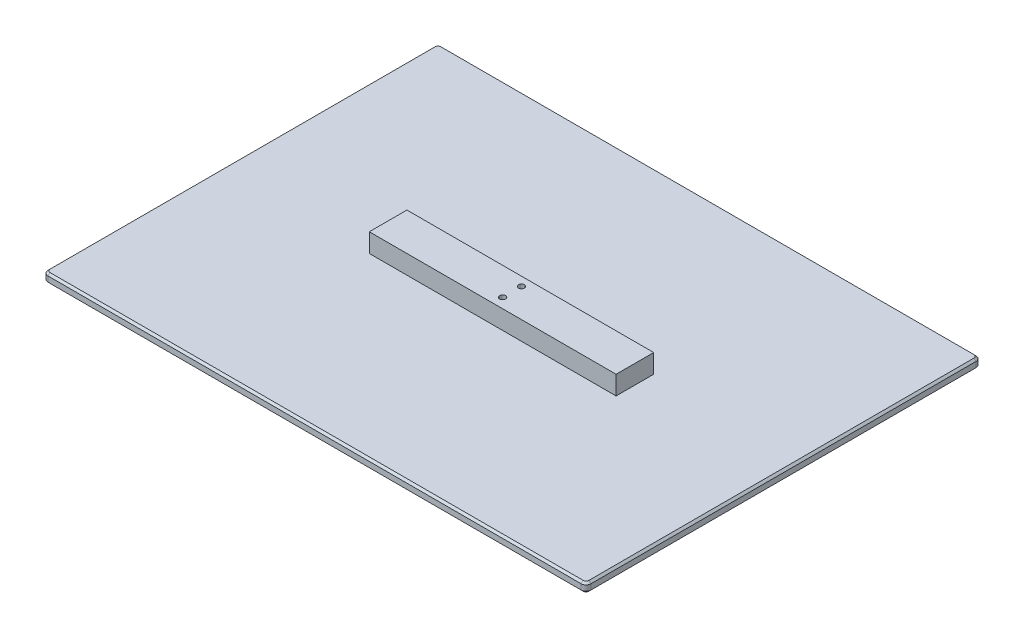
ISO-10303-21;
HEADER;
FILE_DESCRIPTION(('STEP AP214'),'2;1');
FILE_NAME('part.step','',(''),(''),'','','');
FILE_SCHEMA(('AUTOMOTIVE_DESIGN { 1 0 10303 214 1 1 1 1 }'));
ENDSEC;
DATA;
#1=APPLICATION_CONTEXT('core data for automotive mechanical design processes');
#2=APPLICATION_PROTOCOL_DEFINITION('international standard','automotive_design',2000,#1);
#3=PRODUCT_CONTEXT('',#1,'mechanical');
#4=PRODUCT('Part','Part','',(#3));
#5=PRODUCT_RELATED_PRODUCT_CATEGORY('part','',(#4));
#6=PRODUCT_DEFINITION_FORMATION('','',#4);
#7=PRODUCT_DEFINITION_CONTEXT('part definition',#1,'design');
#8=PRODUCT_DEFINITION('design','',#6,#7);
#9=PRODUCT_DEFINITION_SHAPE('','',#8);
#10=(LENGTH_UNIT() NAMED_UNIT(*) SI_UNIT(.MILLI.,.METRE.));
#11=(NAMED_UNIT(*) PLANE_ANGLE_UNIT() SI_UNIT($,.RADIAN.));
#12=(NAMED_UNIT(*) SI_UNIT($,.STERADIAN.) SOLID_ANGLE_UNIT());
#13=UNCERTAINTY_MEASURE_WITH_UNIT(LENGTH_MEASURE(1.E-05),#10,'distance_accuracy_value','');
#14=(GEOMETRIC_REPRESENTATION_CONTEXT(3) GLOBAL_UNCERTAINTY_ASSIGNED_CONTEXT((#13)) GLOBAL_UNIT_ASSIGNED_CONTEXT((#10,
#11,#12)) REPRESENTATION_CONTEXT('',''));
#15=CARTESIAN_POINT('',(0.,0.,0.));
#16=DIRECTION('',(0.,0.,1.));
#17=DIRECTION('',(1.,0.,0.));
#18=AXIS2_PLACEMENT_3D('',#15,#16,#17);
#19=CARTESIAN_POINT('',(0.,9.525,0.));
#20=DIRECTION('',(0.,1.,0.));
#21=DIRECTION('',(0.,0.,1.));
#22=AXIS2_PLACEMENT_3D('',#19,#20,#21);
#23=PLANE('',#22);
#24=CARTESIAN_POINT('',(270.,9.525,-195.));
#25=DIRECTION('',(0.,1.,0.));
#26=DIRECTION('',(0.,0.,1.));
#27=AXIS2_PLACEMENT_3D('',#24,#25,#26);
#28=CIRCLE('',#27,3.);
#29=CARTESIAN_POINT('',(273.,9.525,-195.));
#30=VERTEX_POINT('',#29);
#31=CARTESIAN_POINT('',(270.,9.525,-198.));
#32=VERTEX_POINT('',#31);
#33=EDGE_CURVE('E235',#30,#32,#28,.T.);
#34=ORIENTED_EDGE('',*,*,#33,.T.);
#35=DIRECTION('',(-1.,0.,0.));
#36=VECTOR('',#35,1.);
#37=CARTESIAN_POINT('',(-270.,9.525,-198.));
#38=LINE('',#37,#36);
#39=CARTESIAN_POINT('',(-270.,9.525,-198.));
#40=VERTEX_POINT('',#39);
#41=EDGE_CURVE('E239',#32,#40,#38,.T.);
#42=ORIENTED_EDGE('',*,*,#41,.T.);
#43=CARTESIAN_POINT('',(-270.,9.525,-195.));
#44=DIRECTION('',(0.,1.,0.));
#45=DIRECTION('',(0.,0.,1.));
#46=AXIS2_PLACEMENT_3D('',#43,#44,#45);
#47=CIRCLE('',#46,3.);
#48=CARTESIAN_POINT('',(-273.,9.525,-195.));
#49=VERTEX_POINT('',#48);
#50=EDGE_CURVE('E237',#40,#49,#47,.T.);
#51=ORIENTED_EDGE('',*,*,#50,.T.);
#52=DIRECTION('',(0.,0.,1.));
#53=VECTOR('',#52,1.);
#54=CARTESIAN_POINT('',(-273.,9.525,195.));
#55=LINE('',#54,#53);
#56=CARTESIAN_POINT('',(-273.,9.525,195.));
#57=VERTEX_POINT('',#56);
#58=EDGE_CURVE('E233',#49,#57,#55,.T.);
#59=ORIENTED_EDGE('',*,*,#58,.T.);
#60=CARTESIAN_POINT('',(-270.,9.525,195.));
#61=DIRECTION('',(0.,1.,0.));
#62=DIRECTION('',(0.,0.,1.));
#63=AXIS2_PLACEMENT_3D('',#60,#61,#62);
#64=CIRCLE('',#63,3.);
#65=CARTESIAN_POINT('',(-270.,9.525,198.));
#66=VERTEX_POINT('',#65);
#67=EDGE_CURVE('E229',#57,#66,#64,.T.);
#68=ORIENTED_EDGE('',*,*,#67,.T.);
#69=DIRECTION('',(1.,0.,0.));
#70=VECTOR('',#69,1.);
#71=CARTESIAN_POINT('',(270.,9.525,198.));
#72=LINE('',#71,#70);
#73=CARTESIAN_POINT('',(270.,9.525,198.));
#74=VERTEX_POINT('',#73);
#75=EDGE_CURVE('E225',#66,#74,#72,.T.);
#76=ORIENTED_EDGE('',*,*,#75,.T.);
#77=CARTESIAN_POINT('',(270.,9.525,195.));
#78=DIRECTION('',(0.,1.,0.));
#79=DIRECTION('',(0.,0.,1.));
#80=AXIS2_PLACEMENT_3D('',#77,#78,#79);
#81=CIRCLE('',#80,3.);
#82=CARTESIAN_POINT('',(273.,9.525,195.));
#83=VERTEX_POINT('',#82);
#84=EDGE_CURVE('E227',#74,#83,#81,.T.);
#85=ORIENTED_EDGE('',*,*,#84,.T.);
#86=DIRECTION('',(0.,0.,-1.));
#87=VECTOR('',#86,1.);
#88=CARTESIAN_POINT('',(273.,9.525,-195.));
#89=LINE('',#88,#87);
#90=EDGE_CURVE('E231',#83,#30,#89,.T.);
#91=ORIENTED_EDGE('',*,*,#90,.T.);
#92=EDGE_LOOP('',(#34,#42,#51,#59,#68,#76,#85,#91));
#93=FACE_BOUND('',#92,.T.);
#94=DIRECTION('',(-1.,0.,0.));
#95=VECTOR('',#94,1.);
#96=CARTESIAN_POINT('',(-125.,9.525,-18.55));
#97=LINE('',#96,#95);
#98=CARTESIAN_POINT('',(125.,9.525,-18.55));
#99=VERTEX_POINT('',#98);
#100=CARTESIAN_POINT('',(-125.,9.525,-18.55));
#101=VERTEX_POINT('',#100);
#102=EDGE_CURVE('E743',#99,#101,#97,.T.);
#103=ORIENTED_EDGE('',*,*,#102,.F.);
#104=DIRECTION('',(0.,0.,-1.));
#105=VECTOR('',#104,1.);
#106=CARTESIAN_POINT('',(125.,9.525,-18.55));
#107=LINE('',#106,#105);
#108=CARTESIAN_POINT('',(125.,9.525,19.55));
#109=VERTEX_POINT('',#108);
#110=EDGE_CURVE('E196',#109,#99,#107,.T.);
#111=ORIENTED_EDGE('',*,*,#110,.F.);
#112=DIRECTION('',(1.,0.,0.));
#113=VECTOR('',#112,1.);
#114=CARTESIAN_POINT('',(-125.,9.525,19.55));
#115=LINE('',#114,#113);
#116=CARTESIAN_POINT('',(-125.,9.525,19.55));
#117=VERTEX_POINT('',#116);
#118=EDGE_CURVE('E192',#117,#109,#115,.T.);
#119=ORIENTED_EDGE('',*,*,#118,.F.);
#120=DIRECTION('',(0.,0.,1.));
#121=VECTOR('',#120,1.);
#122=CARTESIAN_POINT('',(-125.,9.525,-18.55));
#123=LINE('',#122,#121);
#124=EDGE_CURVE('E745',#101,#117,#123,.T.);
#125=ORIENTED_EDGE('',*,*,#124,.F.);
#126=EDGE_LOOP('',(#103,#111,#119,#125));
#127=FACE_BOUND('',#126,.T.);
#128=ADVANCED_FACE('F35',(#93,#127),#23,.T.);
#129=CARTESIAN_POINT('',(275.,9.525,-200.));
#130=DIRECTION('',(-1.,0.,0.));
#131=DIRECTION('',(0.,0.,1.));
#132=AXIS2_PLACEMENT_3D('',#129,#130,#131);
#133=PLANE('',#132);
#134=DIRECTION('',(0.,-1.,0.));
#135=VECTOR('',#134,1.);
#136=CARTESIAN_POINT('',(275.,9.525,195.));
#137=LINE('',#136,#135);
#138=CARTESIAN_POINT('',(275.,7.52500000000005,195.));
#139=VERTEX_POINT('',#138);
#140=CARTESIAN_POINT('',(275.,1.99999999999995,195.));
#141=VERTEX_POINT('',#140);
#142=EDGE_CURVE('E216',#139,#141,#137,.T.);
#143=ORIENTED_EDGE('',*,*,#142,.T.);
#144=DIRECTION('',(0.,0.,-1.));
#145=VECTOR('',#144,1.);
#146=CARTESIAN_POINT('',(275.,1.99999999999995,-200.));
#147=LINE('',#146,#145);
#148=CARTESIAN_POINT('',(275.,1.99999999999995,-195.));
#149=VERTEX_POINT('',#148);
#150=EDGE_CURVE('E310',#141,#149,#147,.T.);
#151=ORIENTED_EDGE('',*,*,#150,.T.);
#152=DIRECTION('',(0.,-1.,0.));
#153=VECTOR('',#152,1.);
#154=CARTESIAN_POINT('',(275.,9.525,-195.));
#155=LINE('',#154,#153);
#156=CARTESIAN_POINT('',(275.,7.52500000000005,-195.));
#157=VERTEX_POINT('',#156);
#158=EDGE_CURVE('E219',#149,#157,#155,.F.);
#159=ORIENTED_EDGE('',*,*,#158,.T.);
#160=DIRECTION('',(0.,0.,1.));
#161=VECTOR('',#160,1.);
#162=CARTESIAN_POINT('',(275.,7.52500000000005,195.));
#163=LINE('',#162,#161);
#164=EDGE_CURVE('E253',#157,#139,#163,.T.);
#165=ORIENTED_EDGE('',*,*,#164,.T.);
#166=EDGE_LOOP('',(#143,#151,#159,#165));
#167=FACE_BOUND('',#166,.T.);
#168=ADVANCED_FACE('F389',(#167),#133,.F.);
#169=CARTESIAN_POINT('',(-275.,9.525,-200.));
#170=DIRECTION('',(0.,0.,1.));
#171=DIRECTION('',(1.,0.,0.));
#172=AXIS2_PLACEMENT_3D('',#169,#170,#171);
#173=PLANE('',#172);
#174=DIRECTION('',(0.,-1.,0.));
#175=VECTOR('',#174,1.);
#176=CARTESIAN_POINT('',(270.,9.525,-200.));
#177=LINE('',#176,#175);
#178=CARTESIAN_POINT('',(270.,7.52500000000005,-200.));
#179=VERTEX_POINT('',#178);
#180=CARTESIAN_POINT('',(270.,1.99999999999995,-200.));
#181=VERTEX_POINT('',#180);
#182=EDGE_CURVE('E211',#179,#181,#177,.T.);
#183=ORIENTED_EDGE('',*,*,#182,.T.);
#184=DIRECTION('',(-1.,0.,0.));
#185=VECTOR('',#184,1.);
#186=CARTESIAN_POINT('',(-275.,1.99999999999995,-200.));
#187=LINE('',#186,#185);
#188=CARTESIAN_POINT('',(-270.,1.99999999999995,-200.));
#189=VERTEX_POINT('',#188);
#190=EDGE_CURVE('E263',#181,#189,#187,.T.);
#191=ORIENTED_EDGE('',*,*,#190,.T.);
#192=DIRECTION('',(0.,-1.,0.));
#193=VECTOR('',#192,1.);
#194=CARTESIAN_POINT('',(-270.,9.525,-200.));
#195=LINE('',#194,#193);
#196=CARTESIAN_POINT('',(-270.,7.52500000000005,-200.));
#197=VERTEX_POINT('',#196);
#198=EDGE_CURVE('E214',#189,#197,#195,.F.);
#199=ORIENTED_EDGE('',*,*,#198,.T.);
#200=DIRECTION('',(1.,0.,0.));
#201=VECTOR('',#200,1.);
#202=CARTESIAN_POINT('',(270.,7.52500000000005,-200.));
#203=LINE('',#202,#201);
#204=EDGE_CURVE('E242',#197,#179,#203,.T.);
#205=ORIENTED_EDGE('',*,*,#204,.T.);
#206=EDGE_LOOP('',(#183,#191,#199,#205));
#207=FACE_BOUND('',#206,.T.);
#208=ADVANCED_FACE('F361',(#207),#173,.F.);
#209=CARTESIAN_POINT('',(-275.,9.525,-200.));
#210=DIRECTION('',(1.,0.,0.));
#211=DIRECTION('',(0.,0.,-1.));
#212=AXIS2_PLACEMENT_3D('',#209,#210,#211);
#213=PLANE('',#212);
#214=DIRECTION('',(0.,-1.,0.));
#215=VECTOR('',#214,1.);
#216=CARTESIAN_POINT('',(-275.,9.525,-195.));
#217=LINE('',#216,#215);
#218=CARTESIAN_POINT('',(-275.,7.52500000000005,-195.));
#219=VERTEX_POINT('',#218);
#220=CARTESIAN_POINT('',(-275.,1.99999999999995,-195.));
#221=VERTEX_POINT('',#220);
#222=EDGE_CURVE('E207',#219,#221,#217,.T.);
#223=ORIENTED_EDGE('',*,*,#222,.T.);
#224=DIRECTION('',(0.,0.,1.));
#225=VECTOR('',#224,1.);
#226=CARTESIAN_POINT('',(-275.,1.99999999999995,-200.));
#227=LINE('',#226,#225);
#228=CARTESIAN_POINT('',(-275.,1.99999999999995,195.));
#229=VERTEX_POINT('',#228);
#230=EDGE_CURVE('E308',#221,#229,#227,.T.);
#231=ORIENTED_EDGE('',*,*,#230,.T.);
#232=DIRECTION('',(0.,-1.,0.));
#233=VECTOR('',#232,1.);
#234=CARTESIAN_POINT('',(-275.,9.525,195.));
#235=LINE('',#234,#233);
#236=CARTESIAN_POINT('',(-275.,7.52500000000005,195.));
#237=VERTEX_POINT('',#236);
#238=EDGE_CURVE('E205',#229,#237,#235,.F.);
#239=ORIENTED_EDGE('',*,*,#238,.T.);
#240=DIRECTION('',(0.,0.,-1.));
#241=VECTOR('',#240,1.);
#242=CARTESIAN_POINT('',(-275.,7.52500000000005,-195.));
#243=LINE('',#242,#241);
#244=EDGE_CURVE('E251',#237,#219,#243,.T.);
#245=ORIENTED_EDGE('',*,*,#244,.T.);
#246=EDGE_LOOP('',(#223,#231,#239,#245));
#247=FACE_BOUND('',#246,.T.);
#248=ADVANCED_FACE('F427',(#247),#213,.F.);
#249=CARTESIAN_POINT('',(-275.,9.525,200.));
#250=DIRECTION('',(0.,0.,-1.));
#251=DIRECTION('',(-1.,0.,0.));
#252=AXIS2_PLACEMENT_3D('',#249,#250,#251);
#253=PLANE('',#252);
#254=DIRECTION('',(0.,-1.,0.));
#255=VECTOR('',#254,1.);
#256=CARTESIAN_POINT('',(-270.,9.525,200.));
#257=LINE('',#256,#255);
#258=CARTESIAN_POINT('',(-270.,7.52500000000005,200.));
#259=VERTEX_POINT('',#258);
#260=CARTESIAN_POINT('',(-270.,1.99999999999995,200.));
#261=VERTEX_POINT('',#260);
#262=EDGE_CURVE('E221',#259,#261,#257,.T.);
#263=ORIENTED_EDGE('',*,*,#262,.T.);
#264=DIRECTION('',(1.,0.,0.));
#265=VECTOR('',#264,1.);
#266=CARTESIAN_POINT('',(-275.,1.99999999999995,200.));
#267=LINE('',#266,#265);
#268=CARTESIAN_POINT('',(270.,1.99999999999995,200.));
#269=VERTEX_POINT('',#268);
#270=EDGE_CURVE('E11',#261,#269,#267,.T.);
#271=ORIENTED_EDGE('',*,*,#270,.T.);
#272=DIRECTION('',(0.,-1.,0.));
#273=VECTOR('',#272,1.);
#274=CARTESIAN_POINT('',(270.,9.525,200.));
#275=LINE('',#274,#273);
#276=CARTESIAN_POINT('',(270.,7.52500000000005,200.));
#277=VERTEX_POINT('',#276);
#278=EDGE_CURVE('E223',#269,#277,#275,.F.);
#279=ORIENTED_EDGE('',*,*,#278,.T.);
#280=DIRECTION('',(-1.,0.,0.));
#281=VECTOR('',#280,1.);
#282=CARTESIAN_POINT('',(-270.,7.52500000000005,200.));
#283=LINE('',#282,#281);
#284=EDGE_CURVE('E261',#277,#259,#283,.T.);
#285=ORIENTED_EDGE('',*,*,#284,.T.);
#286=EDGE_LOOP('',(#263,#271,#279,#285));
#287=FACE_BOUND('',#286,.T.);
#288=ADVANCED_FACE('F404',(#287),#253,.F.);
#289=CARTESIAN_POINT('',(0.,0.,0.));
#290=DIRECTION('',(0.,1.,0.));
#291=DIRECTION('',(0.,0.,1.));
#292=AXIS2_PLACEMENT_3D('',#289,#290,#291);
#293=PLANE('',#292);
#294=CARTESIAN_POINT('',(-270.,0.,-195.));
#295=DIRECTION('',(0.,1.,0.));
#296=DIRECTION('',(0.,0.,1.));
#297=AXIS2_PLACEMENT_3D('',#294,#295,#296);
#298=CIRCLE('',#297,3.);
#299=CARTESIAN_POINT('',(-273.,0.,-195.));
#300=VERTEX_POINT('',#299);
#301=CARTESIAN_POINT('',(-270.,0.,-198.));
#302=VERTEX_POINT('',#301);
#303=EDGE_CURVE('E299',#300,#302,#298,.F.);
#304=ORIENTED_EDGE('',*,*,#303,.T.);
#305=DIRECTION('',(1.,0.,0.));
#306=VECTOR('',#305,1.);
#307=CARTESIAN_POINT('',(0.,0.,-198.));
#308=LINE('',#307,#306);
#309=CARTESIAN_POINT('',(270.,0.,-198.));
#310=VERTEX_POINT('',#309);
#311=EDGE_CURVE('E301',#302,#310,#308,.T.);
#312=ORIENTED_EDGE('',*,*,#311,.T.);
#313=CARTESIAN_POINT('',(270.,0.,-195.));
#314=DIRECTION('',(0.,1.,0.));
#315=DIRECTION('',(0.,0.,1.));
#316=AXIS2_PLACEMENT_3D('',#313,#314,#315);
#317=CIRCLE('',#316,3.);
#318=CARTESIAN_POINT('',(273.,0.,-195.));
#319=VERTEX_POINT('',#318);
#320=EDGE_CURVE('E297',#310,#319,#317,.F.);
#321=ORIENTED_EDGE('',*,*,#320,.T.);
#322=DIRECTION('',(0.,0.,1.));
#323=VECTOR('',#322,1.);
#324=CARTESIAN_POINT('',(273.,0.,0.));
#325=LINE('',#324,#323);
#326=CARTESIAN_POINT('',(273.,0.,195.));
#327=VERTEX_POINT('',#326);
#328=EDGE_CURVE('E293',#319,#327,#325,.T.);
#329=ORIENTED_EDGE('',*,*,#328,.T.);
#330=CARTESIAN_POINT('',(270.,0.,195.));
#331=DIRECTION('',(0.,1.,0.));
#332=DIRECTION('',(0.,0.,1.));
#333=AXIS2_PLACEMENT_3D('',#330,#331,#332);
#334=CIRCLE('',#333,3.);
#335=CARTESIAN_POINT('',(270.,0.,198.));
#336=VERTEX_POINT('',#335);
#337=EDGE_CURVE('E289',#327,#336,#334,.F.);
#338=ORIENTED_EDGE('',*,*,#337,.T.);
#339=DIRECTION('',(-1.,0.,0.));
#340=VECTOR('',#339,1.);
#341=CARTESIAN_POINT('',(0.,0.,198.));
#342=LINE('',#341,#340);
#343=CARTESIAN_POINT('',(-270.,0.,198.));
#344=VERTEX_POINT('',#343);
#345=EDGE_CURVE('E287',#336,#344,#342,.T.);
#346=ORIENTED_EDGE('',*,*,#345,.T.);
#347=CARTESIAN_POINT('',(-270.,0.,195.));
#348=DIRECTION('',(0.,1.,0.));
#349=DIRECTION('',(0.,0.,1.));
#350=AXIS2_PLACEMENT_3D('',#347,#348,#349);
#351=CIRCLE('',#350,3.);
#352=CARTESIAN_POINT('',(-273.,0.,195.));
#353=VERTEX_POINT('',#352);
#354=EDGE_CURVE('E291',#344,#353,#351,.F.);
#355=ORIENTED_EDGE('',*,*,#354,.T.);
#356=DIRECTION('',(0.,0.,-1.));
#357=VECTOR('',#356,1.);
#358=CARTESIAN_POINT('',(-273.,0.,0.));
#359=LINE('',#358,#357);
#360=EDGE_CURVE('E295',#353,#300,#359,.T.);
#361=ORIENTED_EDGE('',*,*,#360,.T.);
#362=EDGE_LOOP('',(#304,#312,#321,#329,#338,#346,#355,#361));
#363=FACE_BOUND('',#362,.T.);
#364=ADVANCED_FACE('F343',(#363),#293,.F.);
#365=CARTESIAN_POINT('',(-270.,9.525,-195.));
#366=DIRECTION('',(0.,-1.,0.));
#367=DIRECTION('',(0.,0.,-1.));
#368=AXIS2_PLACEMENT_3D('',#365,#366,#367);
#369=CYLINDRICAL_SURFACE('',#368,5.);
#370=ORIENTED_EDGE('',*,*,#198,.F.);
#371=CARTESIAN_POINT('',(-270.,1.99999999999995,-195.));
#372=DIRECTION('',(0.,1.,0.));
#373=DIRECTION('',(0.,0.,1.));
#374=AXIS2_PLACEMENT_3D('',#371,#372,#373);
#375=CIRCLE('',#374,5.);
#376=EDGE_CURVE('E304',#189,#221,#375,.T.);
#377=ORIENTED_EDGE('',*,*,#376,.T.);
#378=ORIENTED_EDGE('',*,*,#222,.F.);
#379=CARTESIAN_POINT('',(-270.,7.52500000000005,-195.));
#380=DIRECTION('',(0.,1.,0.));
#381=DIRECTION('',(0.,0.,1.));
#382=AXIS2_PLACEMENT_3D('',#379,#380,#381);
#383=CIRCLE('',#382,5.);
#384=EDGE_CURVE('E245',#219,#197,#383,.F.);
#385=ORIENTED_EDGE('',*,*,#384,.T.);
#386=EDGE_LOOP('',(#370,#377,#378,#385));
#387=FACE_BOUND('',#386,.T.);
#388=ADVANCED_FACE('F425',(#387),#369,.T.);
#389=CARTESIAN_POINT('',(270.,9.525,-195.));
#390=DIRECTION('',(0.,-1.,0.));
#391=DIRECTION('',(0.,0.,-1.));
#392=AXIS2_PLACEMENT_3D('',#389,#390,#391);
#393=CYLINDRICAL_SURFACE('',#392,5.);
#394=ORIENTED_EDGE('',*,*,#158,.F.);
#395=CARTESIAN_POINT('',(270.,1.99999999999995,-195.));
#396=DIRECTION('',(0.,1.,0.));
#397=DIRECTION('',(0.,0.,1.));
#398=AXIS2_PLACEMENT_3D('',#395,#396,#397);
#399=CIRCLE('',#398,5.);
#400=EDGE_CURVE('E306',#149,#181,#399,.T.);
#401=ORIENTED_EDGE('',*,*,#400,.T.);
#402=ORIENTED_EDGE('',*,*,#182,.F.);
#403=CARTESIAN_POINT('',(270.,7.52500000000005,-195.));
#404=DIRECTION('',(0.,1.,0.));
#405=DIRECTION('',(0.,0.,1.));
#406=AXIS2_PLACEMENT_3D('',#403,#404,#405);
#407=CIRCLE('',#406,5.);
#408=EDGE_CURVE('E248',#179,#157,#407,.F.);
#409=ORIENTED_EDGE('',*,*,#408,.T.);
#410=EDGE_LOOP('',(#394,#401,#402,#409));
#411=FACE_BOUND('',#410,.T.);
#412=ADVANCED_FACE('F359',(#411),#393,.T.);
#413=CARTESIAN_POINT('',(270.,9.525,195.));
#414=DIRECTION('',(0.,-1.,0.));
#415=DIRECTION('',(0.,0.,-1.));
#416=AXIS2_PLACEMENT_3D('',#413,#414,#415);
#417=CYLINDRICAL_SURFACE('',#416,5.);
#418=ORIENTED_EDGE('',*,*,#278,.F.);
#419=CARTESIAN_POINT('',(270.,1.99999999999995,195.));
#420=DIRECTION('',(0.,1.,0.));
#421=DIRECTION('',(0.,0.,1.));
#422=AXIS2_PLACEMENT_3D('',#419,#420,#421);
#423=CIRCLE('',#422,5.);
#424=EDGE_CURVE('E44',#269,#141,#423,.T.);
#425=ORIENTED_EDGE('',*,*,#424,.T.);
#426=ORIENTED_EDGE('',*,*,#142,.F.);
#427=CARTESIAN_POINT('',(270.,7.52500000000005,195.));
#428=DIRECTION('',(0.,1.,0.));
#429=DIRECTION('',(0.,0.,1.));
#430=AXIS2_PLACEMENT_3D('',#427,#428,#429);
#431=CIRCLE('',#430,5.);
#432=EDGE_CURVE('E258',#139,#277,#431,.F.);
#433=ORIENTED_EDGE('',*,*,#432,.T.);
#434=EDGE_LOOP('',(#418,#425,#426,#433));
#435=FACE_BOUND('',#434,.T.);
#436=ADVANCED_FACE('F392',(#435),#417,.T.);
#437=CARTESIAN_POINT('',(-270.,9.525,195.));
#438=DIRECTION('',(0.,-1.,0.));
#439=DIRECTION('',(0.,0.,-1.));
#440=AXIS2_PLACEMENT_3D('',#437,#438,#439);
#441=CYLINDRICAL_SURFACE('',#440,5.);
#442=ORIENTED_EDGE('',*,*,#238,.F.);
#443=CARTESIAN_POINT('',(-270.,1.99999999999995,195.));
#444=DIRECTION('',(0.,1.,0.));
#445=DIRECTION('',(0.,0.,1.));
#446=AXIS2_PLACEMENT_3D('',#443,#444,#445);
#447=CIRCLE('',#446,5.);
#448=EDGE_CURVE('E312',#229,#261,#447,.T.);
#449=ORIENTED_EDGE('',*,*,#448,.T.);
#450=ORIENTED_EDGE('',*,*,#262,.F.);
#451=CARTESIAN_POINT('',(-270.,7.52500000000005,195.));
#452=DIRECTION('',(0.,1.,0.));
#453=DIRECTION('',(0.,0.,1.));
#454=AXIS2_PLACEMENT_3D('',#451,#452,#453);
#455=CIRCLE('',#454,5.);
#456=EDGE_CURVE('E255',#259,#237,#455,.F.);
#457=ORIENTED_EDGE('',*,*,#456,.T.);
#458=EDGE_LOOP('',(#442,#449,#450,#457));
#459=FACE_BOUND('',#458,.T.);
#460=ADVANCED_FACE('F407',(#459),#441,.T.);
#461=CARTESIAN_POINT('',(0.,9.525,198.));
#462=DIRECTION('',(0.,0.707106781186557,0.707106781186538));
#463=DIRECTION('',(-1.,0.,0.));
#464=AXIS2_PLACEMENT_3D('',#461,#462,#463);
#465=PLANE('',#464);
#466=DIRECTION('',(0.,0.707106781186538,-0.707106781186557));
#467=VECTOR('',#466,1.);
#468=CARTESIAN_POINT('',(-270.,7.52500000000005,200.));
#469=LINE('',#468,#467);
#470=EDGE_CURVE('E280',#259,#66,#469,.T.);
#471=ORIENTED_EDGE('',*,*,#470,.F.);
#472=ORIENTED_EDGE('',*,*,#284,.F.);
#473=DIRECTION('',(0.,-0.707106781186538,0.707106781186557));
#474=VECTOR('',#473,1.);
#475=CARTESIAN_POINT('',(270.,9.525,198.));
#476=LINE('',#475,#474);
#477=EDGE_CURVE('E208',#74,#277,#476,.T.);
#478=ORIENTED_EDGE('',*,*,#477,.F.);
#479=ORIENTED_EDGE('',*,*,#75,.F.);
#480=EDGE_LOOP('',(#471,#472,#478,#479));
#481=FACE_BOUND('',#480,.T.);
#482=ADVANCED_FACE('F401',(#481),#465,.T.);
#483=CARTESIAN_POINT('',(270.,9.525,195.));
#484=DIRECTION('',(0.,-1.,0.));
#485=DIRECTION('',(0.,0.,-1.));
#486=AXIS2_PLACEMENT_3D('',#483,#484,#485);
#487=CONICAL_SURFACE('',#486,3.,0.785398163397461);
#488=ORIENTED_EDGE('',*,*,#477,.T.);
#489=ORIENTED_EDGE('',*,*,#432,.F.);
#490=DIRECTION('',(0.707106781186557,-0.707106781186538,0.));
#491=VECTOR('',#490,1.);
#492=CARTESIAN_POINT('',(273.,9.525,195.));
#493=LINE('',#492,#491);
#494=EDGE_CURVE('E277',#83,#139,#493,.T.);
#495=ORIENTED_EDGE('',*,*,#494,.F.);
#496=ORIENTED_EDGE('',*,*,#84,.F.);
#497=EDGE_LOOP('',(#488,#489,#495,#496));
#498=FACE_BOUND('',#497,.T.);
#499=ADVANCED_FACE('F395',(#498),#487,.T.);
#500=CARTESIAN_POINT('',(-270.,9.525,195.));
#501=DIRECTION('',(0.,-1.,0.));
#502=DIRECTION('',(0.,0.,-1.));
#503=AXIS2_PLACEMENT_3D('',#500,#501,#502);
#504=CONICAL_SURFACE('',#503,3.,0.785398163397461);
#505=ORIENTED_EDGE('',*,*,#470,.T.);
#506=ORIENTED_EDGE('',*,*,#67,.F.);
#507=DIRECTION('',(0.707106781186557,0.707106781186538,0.));
#508=VECTOR('',#507,1.);
#509=CARTESIAN_POINT('',(-275.,7.52500000000005,195.));
#510=LINE('',#509,#508);
#511=EDGE_CURVE('E274',#237,#57,#510,.T.);
#512=ORIENTED_EDGE('',*,*,#511,.F.);
#513=ORIENTED_EDGE('',*,*,#456,.F.);
#514=EDGE_LOOP('',(#505,#506,#512,#513));
#515=FACE_BOUND('',#514,.T.);
#516=ADVANCED_FACE('F433',(#515),#504,.T.);
#517=CARTESIAN_POINT('',(273.,9.525,0.));
#518=DIRECTION('',(0.707106781186538,0.707106781186557,0.));
#519=DIRECTION('',(0.,0.,1.));
#520=AXIS2_PLACEMENT_3D('',#517,#518,#519);
#521=PLANE('',#520);
#522=ORIENTED_EDGE('',*,*,#494,.T.);
#523=ORIENTED_EDGE('',*,*,#164,.F.);
#524=DIRECTION('',(0.707106781186557,-0.707106781186538,0.));
#525=VECTOR('',#524,1.);
#526=CARTESIAN_POINT('',(273.,9.525,-195.));
#527=LINE('',#526,#525);
#528=EDGE_CURVE('E271',#30,#157,#527,.T.);
#529=ORIENTED_EDGE('',*,*,#528,.F.);
#530=ORIENTED_EDGE('',*,*,#90,.F.);
#531=EDGE_LOOP('',(#522,#523,#529,#530));
#532=FACE_BOUND('',#531,.T.);
#533=ADVANCED_FACE('F385',(#532),#521,.T.);
#534=CARTESIAN_POINT('',(-273.,9.525,0.));
#535=DIRECTION('',(-0.707106781186538,0.707106781186557,0.));
#536=DIRECTION('',(0.,0.,-1.));
#537=AXIS2_PLACEMENT_3D('',#534,#535,#536);
#538=PLANE('',#537);
#539=ORIENTED_EDGE('',*,*,#511,.T.);
#540=ORIENTED_EDGE('',*,*,#58,.F.);
#541=DIRECTION('',(0.707106781186557,0.707106781186538,0.));
#542=VECTOR('',#541,1.);
#543=CARTESIAN_POINT('',(-275.,7.52500000000005,-195.));
#544=LINE('',#543,#542);
#545=EDGE_CURVE('E268',#219,#49,#544,.T.);
#546=ORIENTED_EDGE('',*,*,#545,.F.);
#547=ORIENTED_EDGE('',*,*,#244,.F.);
#548=EDGE_LOOP('',(#539,#540,#546,#547));
#549=FACE_BOUND('',#548,.T.);
#550=ADVANCED_FACE('F430',(#549),#538,.T.);
#551=CARTESIAN_POINT('',(270.,9.525,-195.));
#552=DIRECTION('',(0.,-1.,0.));
#553=DIRECTION('',(0.,0.,-1.));
#554=AXIS2_PLACEMENT_3D('',#551,#552,#553);
#555=CONICAL_SURFACE('',#554,3.,0.785398163397461);
#556=ORIENTED_EDGE('',*,*,#528,.T.);
#557=ORIENTED_EDGE('',*,*,#408,.F.);
#558=DIRECTION('',(0.,-0.707106781186538,-0.707106781186557));
#559=VECTOR('',#558,1.);
#560=CARTESIAN_POINT('',(270.,9.525,-198.));
#561=LINE('',#560,#559);
#562=EDGE_CURVE('E266',#32,#179,#561,.T.);
#563=ORIENTED_EDGE('',*,*,#562,.F.);
#564=ORIENTED_EDGE('',*,*,#33,.F.);
#565=EDGE_LOOP('',(#556,#557,#563,#564));
#566=FACE_BOUND('',#565,.T.);
#567=ADVANCED_FACE('F382',(#566),#555,.T.);
#568=CARTESIAN_POINT('',(-270.,9.525,-195.));
#569=DIRECTION('',(0.,-1.,0.));
#570=DIRECTION('',(0.,0.,-1.));
#571=AXIS2_PLACEMENT_3D('',#568,#569,#570);
#572=CONICAL_SURFACE('',#571,3.,0.785398163397461);
#573=ORIENTED_EDGE('',*,*,#545,.T.);
#574=ORIENTED_EDGE('',*,*,#50,.F.);
#575=DIRECTION('',(0.,0.707106781186538,0.707106781186557));
#576=VECTOR('',#575,1.);
#577=CARTESIAN_POINT('',(-270.,7.52500000000005,-200.));
#578=LINE('',#577,#576);
#579=EDGE_CURVE('E264',#197,#40,#578,.T.);
#580=ORIENTED_EDGE('',*,*,#579,.F.);
#581=ORIENTED_EDGE('',*,*,#384,.F.);
#582=EDGE_LOOP('',(#573,#574,#580,#581));
#583=FACE_BOUND('',#582,.T.);
#584=ADVANCED_FACE('F373',(#583),#572,.T.);
#585=CARTESIAN_POINT('',(0.,9.525,-198.));
#586=DIRECTION('',(0.,0.707106781186557,-0.707106781186538));
#587=DIRECTION('',(1.,0.,0.));
#588=AXIS2_PLACEMENT_3D('',#585,#586,#587);
#589=PLANE('',#588);
#590=ORIENTED_EDGE('',*,*,#562,.T.);
#591=ORIENTED_EDGE('',*,*,#204,.F.);
#592=ORIENTED_EDGE('',*,*,#579,.T.);
#593=ORIENTED_EDGE('',*,*,#41,.F.);
#594=EDGE_LOOP('',(#590,#591,#592,#593));
#595=FACE_BOUND('',#594,.T.);
#596=ADVANCED_FACE('F366',(#595),#589,.T.);
#597=CARTESIAN_POINT('',(-275.,1.99999999999995,200.));
#598=DIRECTION('',(0.,0.707106781186557,-0.707106781186538));
#599=DIRECTION('',(1.,0.,0.));
#600=AXIS2_PLACEMENT_3D('',#597,#598,#599);
#601=PLANE('',#600);
#602=DIRECTION('',(0.,0.707106781186538,0.707106781186557));
#603=VECTOR('',#602,1.);
#604=CARTESIAN_POINT('',(-270.,0.,198.));
#605=LINE('',#604,#603);
#606=EDGE_CURVE('E327',#344,#261,#605,.T.);
#607=ORIENTED_EDGE('',*,*,#606,.F.);
#608=ORIENTED_EDGE('',*,*,#345,.F.);
#609=DIRECTION('',(0.,-0.707106781186538,-0.707106781186557));
#610=VECTOR('',#609,1.);
#611=CARTESIAN_POINT('',(270.,1.99999999999995,200.));
#612=LINE('',#611,#610);
#613=EDGE_CURVE('E39',#269,#336,#612,.T.);
#614=ORIENTED_EDGE('',*,*,#613,.F.);
#615=ORIENTED_EDGE('',*,*,#270,.F.);
#616=EDGE_LOOP('',(#607,#608,#614,#615));
#617=FACE_BOUND('',#616,.T.);
#618=ADVANCED_FACE('F37',(#617),#601,.F.);
#619=CARTESIAN_POINT('',(270.,0.,195.));
#620=DIRECTION('',(0.,1.,0.));
#621=DIRECTION('',(0.,0.,1.));
#622=AXIS2_PLACEMENT_3D('',#619,#620,#621);
#623=CONICAL_SURFACE('',#622,3.,0.785398163397461);
#624=ORIENTED_EDGE('',*,*,#613,.T.);
#625=ORIENTED_EDGE('',*,*,#337,.F.);
#626=DIRECTION('',(-0.707106781186557,-0.707106781186538,0.));
#627=VECTOR('',#626,1.);
#628=CARTESIAN_POINT('',(275.,1.99999999999995,195.));
#629=LINE('',#628,#627);
#630=EDGE_CURVE('E325',#141,#327,#629,.T.);
#631=ORIENTED_EDGE('',*,*,#630,.F.);
#632=ORIENTED_EDGE('',*,*,#424,.F.);
#633=EDGE_LOOP('',(#624,#625,#631,#632));
#634=FACE_BOUND('',#633,.T.);
#635=ADVANCED_FACE('F338',(#634),#623,.T.);
#636=CARTESIAN_POINT('',(-270.,0.,195.));
#637=DIRECTION('',(0.,1.,0.));
#638=DIRECTION('',(0.,0.,1.));
#639=AXIS2_PLACEMENT_3D('',#636,#637,#638);
#640=CONICAL_SURFACE('',#639,3.,0.785398163397461);
#641=ORIENTED_EDGE('',*,*,#606,.T.);
#642=ORIENTED_EDGE('',*,*,#448,.F.);
#643=DIRECTION('',(-0.707106781186557,0.707106781186538,0.));
#644=VECTOR('',#643,1.);
#645=CARTESIAN_POINT('',(-273.,0.,195.));
#646=LINE('',#645,#644);
#647=EDGE_CURVE('E322',#353,#229,#646,.T.);
#648=ORIENTED_EDGE('',*,*,#647,.F.);
#649=ORIENTED_EDGE('',*,*,#354,.F.);
#650=EDGE_LOOP('',(#641,#642,#648,#649));
#651=FACE_BOUND('',#650,.T.);
#652=ADVANCED_FACE('F409',(#651),#640,.T.);
#653=CARTESIAN_POINT('',(275.,1.99999999999995,-200.));
#654=DIRECTION('',(-0.707106781186538,0.707106781186557,0.));
#655=DIRECTION('',(0.,0.,-1.));
#656=AXIS2_PLACEMENT_3D('',#653,#654,#655);
#657=PLANE('',#656);
#658=ORIENTED_EDGE('',*,*,#630,.T.);
#659=ORIENTED_EDGE('',*,*,#328,.F.);
#660=DIRECTION('',(-0.707106781186557,-0.707106781186538,0.));
#661=VECTOR('',#660,1.);
#662=CARTESIAN_POINT('',(275.,1.99999999999995,-195.));
#663=LINE('',#662,#661);
#664=EDGE_CURVE('E319',#149,#319,#663,.T.);
#665=ORIENTED_EDGE('',*,*,#664,.F.);
#666=ORIENTED_EDGE('',*,*,#150,.F.);
#667=EDGE_LOOP('',(#658,#659,#665,#666));
#668=FACE_BOUND('',#667,.T.);
#669=ADVANCED_FACE('F349',(#668),#657,.F.);
#670=CARTESIAN_POINT('',(-275.,1.99999999999995,-200.));
#671=DIRECTION('',(0.707106781186538,0.707106781186557,0.));
#672=DIRECTION('',(0.,0.,1.));
#673=AXIS2_PLACEMENT_3D('',#670,#671,#672);
#674=PLANE('',#673);
#675=ORIENTED_EDGE('',*,*,#647,.T.);
#676=ORIENTED_EDGE('',*,*,#230,.F.);
#677=DIRECTION('',(-0.707106781186557,0.707106781186538,0.));
#678=VECTOR('',#677,1.);
#679=CARTESIAN_POINT('',(-273.,0.,-195.));
#680=LINE('',#679,#678);
#681=EDGE_CURVE('E316',#300,#221,#680,.T.);
#682=ORIENTED_EDGE('',*,*,#681,.F.);
#683=ORIENTED_EDGE('',*,*,#360,.F.);
#684=EDGE_LOOP('',(#675,#676,#682,#683));
#685=FACE_BOUND('',#684,.T.);
#686=ADVANCED_FACE('F413',(#685),#674,.F.);
#687=CARTESIAN_POINT('',(270.,0.,-195.));
#688=DIRECTION('',(0.,1.,0.));
#689=DIRECTION('',(0.,0.,1.));
#690=AXIS2_PLACEMENT_3D('',#687,#688,#689);
#691=CONICAL_SURFACE('',#690,3.,0.785398163397461);
#692=ORIENTED_EDGE('',*,*,#664,.T.);
#693=ORIENTED_EDGE('',*,*,#320,.F.);
#694=DIRECTION('',(0.,-0.707106781186538,0.707106781186557));
#695=VECTOR('',#694,1.);
#696=CARTESIAN_POINT('',(270.,1.99999999999995,-200.));
#697=LINE('',#696,#695);
#698=EDGE_CURVE('E200',#181,#310,#697,.T.);
#699=ORIENTED_EDGE('',*,*,#698,.F.);
#700=ORIENTED_EDGE('',*,*,#400,.F.);
#701=EDGE_LOOP('',(#692,#693,#699,#700));
#702=FACE_BOUND('',#701,.T.);
#703=ADVANCED_FACE('F353',(#702),#691,.T.);
#704=CARTESIAN_POINT('',(-270.,0.,-195.));
#705=DIRECTION('',(0.,1.,0.));
#706=DIRECTION('',(0.,0.,1.));
#707=AXIS2_PLACEMENT_3D('',#704,#705,#706);
#708=CONICAL_SURFACE('',#707,3.,0.785398163397461);
#709=ORIENTED_EDGE('',*,*,#681,.T.);
#710=ORIENTED_EDGE('',*,*,#376,.F.);
#711=DIRECTION('',(0.,0.707106781186538,-0.707106781186557));
#712=VECTOR('',#711,1.);
#713=CARTESIAN_POINT('',(-270.,0.,-198.));
#714=LINE('',#713,#712);
#715=EDGE_CURVE('E198',#302,#189,#714,.T.);
#716=ORIENTED_EDGE('',*,*,#715,.F.);
#717=ORIENTED_EDGE('',*,*,#303,.F.);
#718=EDGE_LOOP('',(#709,#710,#716,#717));
#719=FACE_BOUND('',#718,.T.);
#720=ADVANCED_FACE('F422',(#719),#708,.T.);
#721=CARTESIAN_POINT('',(-275.,1.99999999999995,-200.));
#722=DIRECTION('',(0.,0.707106781186557,0.707106781186538));
#723=DIRECTION('',(-1.,0.,0.));
#724=AXIS2_PLACEMENT_3D('',#721,#722,#723);
#725=PLANE('',#724);
#726=ORIENTED_EDGE('',*,*,#698,.T.);
#727=ORIENTED_EDGE('',*,*,#311,.F.);
#728=ORIENTED_EDGE('',*,*,#715,.T.);
#729=ORIENTED_EDGE('',*,*,#190,.F.);
#730=EDGE_LOOP('',(#726,#727,#728,#729));
#731=FACE_BOUND('',#730,.T.);
#732=ADVANCED_FACE('F420',(#731),#725,.F.);
#733=CARTESIAN_POINT('',(125.,28.575,-18.55));
#734=DIRECTION('',(-1.,0.,0.));
#735=DIRECTION('',(0.,0.,1.));
#736=AXIS2_PLACEMENT_3D('',#733,#734,#735);
#737=PLANE('',#736);
#738=ORIENTED_EDGE('',*,*,#110,.T.);
#739=DIRECTION('',(0.,-1.,0.));
#740=VECTOR('',#739,1.);
#741=CARTESIAN_POINT('',(125.,28.575,-18.55));
#742=LINE('',#741,#740);
#743=CARTESIAN_POINT('',(125.,28.575,-18.55));
#744=VERTEX_POINT('',#743);
#745=EDGE_CURVE('E177',#744,#99,#742,.T.);
#746=ORIENTED_EDGE('',*,*,#745,.F.);
#747=DIRECTION('',(0.,0.,-1.));
#748=VECTOR('',#747,1.);
#749=CARTESIAN_POINT('',(125.,28.575,-18.55));
#750=LINE('',#749,#748);
#751=CARTESIAN_POINT('',(125.,28.575,19.55));
#752=VERTEX_POINT('',#751);
#753=EDGE_CURVE('E184',#752,#744,#750,.T.);
#754=ORIENTED_EDGE('',*,*,#753,.F.);
#755=DIRECTION('',(0.,-1.,0.));
#756=VECTOR('',#755,1.);
#757=CARTESIAN_POINT('',(125.,28.575,19.55));
#758=LINE('',#757,#756);
#759=EDGE_CURVE('E741',#752,#109,#758,.T.);
#760=ORIENTED_EDGE('',*,*,#759,.T.);
#761=EDGE_LOOP('',(#738,#746,#754,#760));
#762=FACE_BOUND('',#761,.T.);
#763=ADVANCED_FACE('F194',(#762),#737,.F.);
#764=CARTESIAN_POINT('',(-125.,28.575,-18.55));
#765=DIRECTION('',(0.,0.,1.));
#766=DIRECTION('',(1.,0.,0.));
#767=AXIS2_PLACEMENT_3D('',#764,#765,#766);
#768=PLANE('',#767);
#769=ORIENTED_EDGE('',*,*,#102,.T.);
#770=DIRECTION('',(0.,-1.,0.));
#771=VECTOR('',#770,1.);
#772=CARTESIAN_POINT('',(-125.,28.575,-18.55));
#773=LINE('',#772,#771);
#774=CARTESIAN_POINT('',(-125.,28.575,-18.55));
#775=VERTEX_POINT('',#774);
#776=EDGE_CURVE('E180',#775,#101,#773,.T.);
#777=ORIENTED_EDGE('',*,*,#776,.F.);
#778=DIRECTION('',(-1.,0.,0.));
#779=VECTOR('',#778,1.);
#780=CARTESIAN_POINT('',(-125.,28.575,-18.55));
#781=LINE('',#780,#779);
#782=EDGE_CURVE('E173',#744,#775,#781,.T.);
#783=ORIENTED_EDGE('',*,*,#782,.F.);
#784=ORIENTED_EDGE('',*,*,#745,.T.);
#785=EDGE_LOOP('',(#769,#777,#783,#784));
#786=FACE_BOUND('',#785,.T.);
#787=ADVANCED_FACE('F175',(#786),#768,.F.);
#788=CARTESIAN_POINT('',(-125.,28.575,-18.55));
#789=DIRECTION('',(1.,0.,0.));
#790=DIRECTION('',(0.,0.,-1.));
#791=AXIS2_PLACEMENT_3D('',#788,#789,#790);
#792=PLANE('',#791);
#793=ORIENTED_EDGE('',*,*,#124,.T.);
#794=DIRECTION('',(0.,-1.,0.));
#795=VECTOR('',#794,1.);
#796=CARTESIAN_POINT('',(-125.,28.575,19.55));
#797=LINE('',#796,#795);
#798=CARTESIAN_POINT('',(-125.,28.575,19.55));
#799=VERTEX_POINT('',#798);
#800=EDGE_CURVE('E52',#799,#117,#797,.T.);
#801=ORIENTED_EDGE('',*,*,#800,.F.);
#802=DIRECTION('',(0.,0.,1.));
#803=VECTOR('',#802,1.);
#804=CARTESIAN_POINT('',(-125.,28.575,-18.55));
#805=LINE('',#804,#803);
#806=EDGE_CURVE('E183',#775,#799,#805,.T.);
#807=ORIENTED_EDGE('',*,*,#806,.F.);
#808=ORIENTED_EDGE('',*,*,#776,.T.);
#809=EDGE_LOOP('',(#793,#801,#807,#808));
#810=FACE_BOUND('',#809,.T.);
#811=ADVANCED_FACE('F549',(#810),#792,.F.);
#812=CARTESIAN_POINT('',(-125.,28.575,19.55));
#813=DIRECTION('',(0.,0.,-1.));
#814=DIRECTION('',(-1.,0.,0.));
#815=AXIS2_PLACEMENT_3D('',#812,#813,#814);
#816=PLANE('',#815);
#817=ORIENTED_EDGE('',*,*,#118,.T.);
#818=ORIENTED_EDGE('',*,*,#759,.F.);
#819=DIRECTION('',(1.,0.,0.));
#820=VECTOR('',#819,1.);
#821=CARTESIAN_POINT('',(-125.,28.575,19.55));
#822=LINE('',#821,#820);
#823=EDGE_CURVE('E188',#799,#752,#822,.T.);
#824=ORIENTED_EDGE('',*,*,#823,.F.);
#825=ORIENTED_EDGE('',*,*,#800,.T.);
#826=EDGE_LOOP('',(#817,#818,#824,#825));
#827=FACE_BOUND('',#826,.T.);
#828=ADVANCED_FACE('F555',(#827),#816,.F.);
#829=CARTESIAN_POINT('',(0.,28.575,0.));
#830=DIRECTION('',(0.,1.,0.));
#831=DIRECTION('',(0.,0.,1.));
#832=AXIS2_PLACEMENT_3D('',#829,#830,#831);
#833=PLANE('',#832);
#834=CARTESIAN_POINT('',(0.,28.575,-9.55));
#835=DIRECTION('',(0.,1.,0.));
#836=DIRECTION('',(0.,0.,1.));
#837=AXIS2_PLACEMENT_3D('',#834,#835,#836);
#838=CIRCLE('',#837,3.);
#839=CARTESIAN_POINT('',(0.,28.575,-6.55));
#840=VERTEX_POINT('',#839);
#841=EDGE_CURVE('E728',#840,#840,#838,.T.);
#842=ORIENTED_EDGE('',*,*,#841,.F.);
#843=EDGE_LOOP('',(#842));
#844=FACE_BOUND('',#843,.T.);
#845=CARTESIAN_POINT('',(0.,28.575,9.55));
#846=DIRECTION('',(0.,1.,0.));
#847=DIRECTION('',(0.,0.,1.));
#848=AXIS2_PLACEMENT_3D('',#845,#846,#847);
#849=CIRCLE('',#848,3.);
#850=CARTESIAN_POINT('',(0.,28.575,12.55));
#851=VERTEX_POINT('',#850);
#852=EDGE_CURVE('E729',#851,#851,#849,.T.);
#853=ORIENTED_EDGE('',*,*,#852,.F.);
#854=EDGE_LOOP('',(#853));
#855=FACE_BOUND('',#854,.T.);
#856=ORIENTED_EDGE('',*,*,#753,.T.);
#857=ORIENTED_EDGE('',*,*,#782,.T.);
#858=ORIENTED_EDGE('',*,*,#806,.T.);
#859=ORIENTED_EDGE('',*,*,#823,.T.);
#860=EDGE_LOOP('',(#856,#857,#858,#859));
#861=FACE_BOUND('',#860,.T.);
#862=ADVANCED_FACE('F187',(#844,#855,#861),#833,.T.);
#863=CARTESIAN_POINT('',(0.,28.575,9.55));
#864=DIRECTION('',(0.,-1.,0.));
#865=DIRECTION('',(0.,0.,-1.));
#866=AXIS2_PLACEMENT_3D('',#863,#864,#865);
#867=CYLINDRICAL_SURFACE('',#866,3.);
#868=ORIENTED_EDGE('',*,*,#852,.T.);
#869=EDGE_LOOP('',(#868));
#870=FACE_BOUND('',#869,.T.);
#871=CARTESIAN_POINT('',(0.,9.525,9.55));
#872=DIRECTION('',(0.,1.,0.));
#873=DIRECTION('',(0.,0.,1.));
#874=AXIS2_PLACEMENT_3D('',#871,#872,#873);
#875=CIRCLE('',#874,3.);
#876=CARTESIAN_POINT('',(0.,9.525,12.55));
#877=VERTEX_POINT('',#876);
#878=EDGE_CURVE('E734',#877,#877,#875,.T.);
#879=ORIENTED_EDGE('',*,*,#878,.F.);
#880=EDGE_LOOP('',(#879));
#881=FACE_BOUND('',#880,.T.);
#882=ADVANCED_FACE('F569',(#870,#881),#867,.F.);
#883=CARTESIAN_POINT('',(0.,9.525,9.55));
#884=DIRECTION('',(0.,1.,0.));
#885=DIRECTION('',(0.,0.,1.));
#886=AXIS2_PLACEMENT_3D('',#883,#884,#885);
#887=PLANE('',#886);
#888=ORIENTED_EDGE('',*,*,#878,.T.);
#889=EDGE_LOOP('',(#888));
#890=FACE_BOUND('',#889,.T.);
#891=ADVANCED_FACE('F577',(#890),#887,.T.);
#892=CARTESIAN_POINT('',(0.,28.575,-9.55));
#893=DIRECTION('',(0.,-1.,0.));
#894=DIRECTION('',(0.,0.,-1.));
#895=AXIS2_PLACEMENT_3D('',#892,#893,#894);
#896=CYLINDRICAL_SURFACE('',#895,3.);
#897=ORIENTED_EDGE('',*,*,#841,.T.);
#898=EDGE_LOOP('',(#897));
#899=FACE_BOUND('',#898,.T.);
#900=CARTESIAN_POINT('',(0.,9.525,-9.55));
#901=DIRECTION('',(0.,1.,0.));
#902=DIRECTION('',(0.,0.,1.));
#903=AXIS2_PLACEMENT_3D('',#900,#901,#902);
#904=CIRCLE('',#903,3.);
#905=CARTESIAN_POINT('',(0.,9.525,-6.55));
#906=VERTEX_POINT('',#905);
#907=EDGE_CURVE('E726',#906,#906,#904,.T.);
#908=ORIENTED_EDGE('',*,*,#907,.F.);
#909=EDGE_LOOP('',(#908));
#910=FACE_BOUND('',#909,.T.);
#911=ADVANCED_FACE('F585',(#899,#910),#896,.F.);
#912=CARTESIAN_POINT('',(0.,9.525,-9.55));
#913=DIRECTION('',(0.,1.,0.));
#914=DIRECTION('',(0.,0.,1.));
#915=AXIS2_PLACEMENT_3D('',#912,#913,#914);
#916=PLANE('',#915);
#917=ORIENTED_EDGE('',*,*,#907,.T.);
#918=EDGE_LOOP('',(#917));
#919=FACE_BOUND('',#918,.T.);
#920=ADVANCED_FACE('F593',(#919),#916,.T.);
#921=CLOSED_SHELL('',(#128,#168,#208,#248,#288,#364,#388,#412,#436,#460,#482,#499,#516,#533,
#550,#567,#584,#596,#618,#635,#652,#669,#686,#703,#720,#732,#763,#787,#811,#828,#862,#882,#891,
#911,#920));
#922=MANIFOLD_SOLID_BREP('B2',#921);
#923=ADVANCED_BREP_SHAPE_REPRESENTATION('',(#18,#922),#14);
#924=SHAPE_DEFINITION_REPRESENTATION(#9,#923);
ENDSEC;
END-ISO-10303-21;
